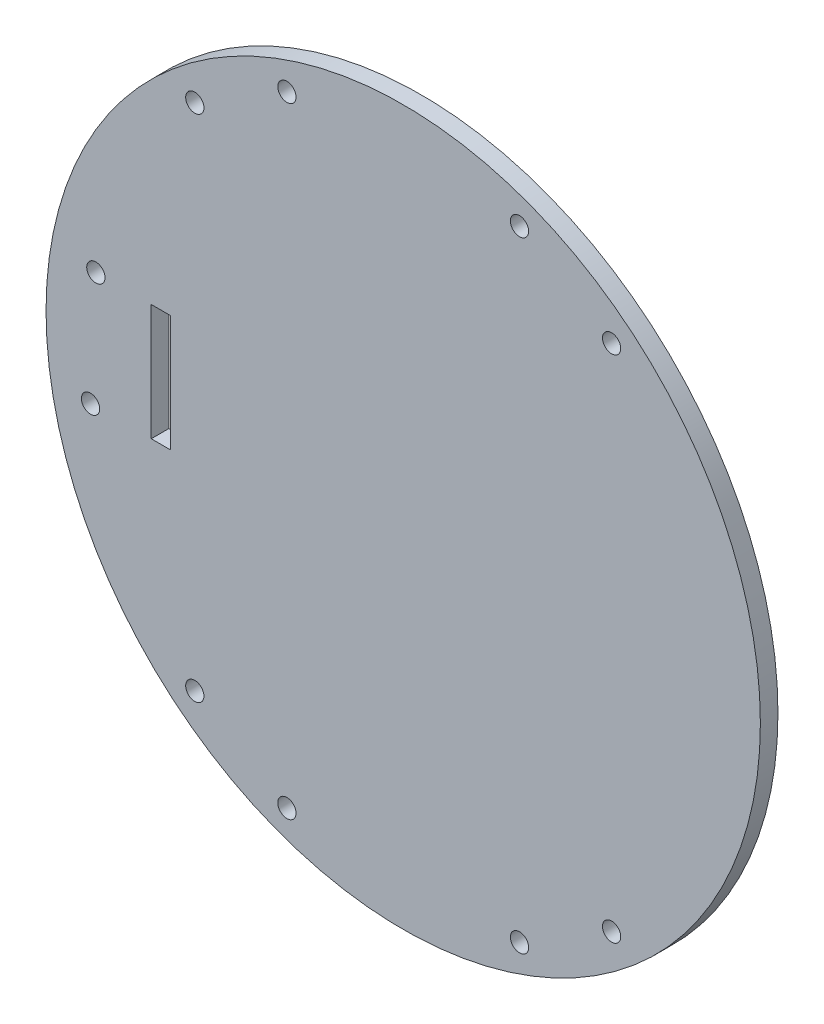
ISO-10303-21;
HEADER;
FILE_DESCRIPTION(('STEP AP214'),'2;1');
FILE_NAME('part.step','',(''),(''),'','','');
FILE_SCHEMA(('AUTOMOTIVE_DESIGN { 1 0 10303 214 1 1 1 1 }'));
ENDSEC;
DATA;
#1=APPLICATION_CONTEXT('core data for automotive mechanical design processes');
#2=APPLICATION_PROTOCOL_DEFINITION('international standard','automotive_design',2000,#1);
#3=PRODUCT_CONTEXT('',#1,'mechanical');
#4=PRODUCT('Part','Part','',(#3));
#5=PRODUCT_RELATED_PRODUCT_CATEGORY('part','',(#4));
#6=PRODUCT_DEFINITION_FORMATION('','',#4);
#7=PRODUCT_DEFINITION_CONTEXT('part definition',#1,'design');
#8=PRODUCT_DEFINITION('design','',#6,#7);
#9=PRODUCT_DEFINITION_SHAPE('','',#8);
#10=(LENGTH_UNIT() NAMED_UNIT(*) SI_UNIT(.MILLI.,.METRE.));
#11=(NAMED_UNIT(*) PLANE_ANGLE_UNIT() SI_UNIT($,.RADIAN.));
#12=(NAMED_UNIT(*) SI_UNIT($,.STERADIAN.) SOLID_ANGLE_UNIT());
#13=UNCERTAINTY_MEASURE_WITH_UNIT(LENGTH_MEASURE(1.E-05),#10,'distance_accuracy_value','');
#14=(GEOMETRIC_REPRESENTATION_CONTEXT(3) GLOBAL_UNCERTAINTY_ASSIGNED_CONTEXT((#13)) GLOBAL_UNIT_ASSIGNED_CONTEXT((#10,
#11,#12)) REPRESENTATION_CONTEXT('',''));
#15=CARTESIAN_POINT('',(0.,0.,0.));
#16=DIRECTION('',(0.,0.,1.));
#17=DIRECTION('',(1.,0.,0.));
#18=AXIS2_PLACEMENT_3D('',#15,#16,#17);
#19=CARTESIAN_POINT('',(-14.9422678098331,5.63357424231195,3.175));
#20=DIRECTION('',(0.,0.,1.));
#21=DIRECTION('',(1.,0.,0.));
#22=AXIS2_PLACEMENT_3D('',#19,#20,#21);
#23=PLANE('',#22);
#24=CARTESIAN_POINT('',(6.05773219016692,61.633574242312,3.175));
#25=DIRECTION('',(0.,0.,1.));
#26=DIRECTION('',(-1.,0.,0.));
#27=AXIS2_PLACEMENT_3D('',#24,#25,#26);
#28=CIRCLE('',#27,1.65);
#29=CARTESIAN_POINT('',(4.40773219016692,61.633574242312,3.175));
#30=VERTEX_POINT('',#29);
#31=EDGE_CURVE('E266',#30,#30,#28,.T.);
#32=ORIENTED_EDGE('',*,*,#31,.F.);
#33=EDGE_LOOP('',(#32));
#34=FACE_BOUND('',#33,.T.);
#35=CARTESIAN_POINT('',(-52.5764221899031,51.6335742423119,3.175));
#36=DIRECTION('',(0.,0.,1.));
#37=DIRECTION('',(1.,0.,0.));
#38=AXIS2_PLACEMENT_3D('',#35,#36,#37);
#39=CIRCLE('',#38,1.65);
#40=CARTESIAN_POINT('',(-50.9264221899031,51.6335742423119,3.175));
#41=VERTEX_POINT('',#40);
#42=EDGE_CURVE('E278',#41,#41,#39,.T.);
#43=ORIENTED_EDGE('',*,*,#42,.F.);
#44=EDGE_LOOP('',(#43));
#45=FACE_BOUND('',#44,.T.);
#46=CARTESIAN_POINT('',(-52.5764221899031,-40.366425757688,3.175));
#47=DIRECTION('',(0.,0.,1.));
#48=DIRECTION('',(-1.,0.,0.));
#49=AXIS2_PLACEMENT_3D('',#46,#47,#48);
#50=CIRCLE('',#49,1.65);
#51=CARTESIAN_POINT('',(-54.2264221899031,-40.366425757688,3.175));
#52=VERTEX_POINT('',#51);
#53=EDGE_CURVE('E290',#52,#52,#50,.T.);
#54=ORIENTED_EDGE('',*,*,#53,.F.);
#55=EDGE_LOOP('',(#54));
#56=FACE_BOUND('',#55,.T.);
#57=CARTESIAN_POINT('',(22.6918865702369,-40.366425757688,3.175));
#58=DIRECTION('',(0.,0.,1.));
#59=DIRECTION('',(1.,0.,0.));
#60=AXIS2_PLACEMENT_3D('',#57,#58,#59);
#61=CIRCLE('',#60,1.65);
#62=CARTESIAN_POINT('',(24.3418865702369,-40.366425757688,3.175));
#63=VERTEX_POINT('',#62);
#64=EDGE_CURVE('E302',#63,#63,#61,.T.);
#65=ORIENTED_EDGE('',*,*,#64,.F.);
#66=EDGE_LOOP('',(#65));
#67=FACE_BOUND('',#66,.T.);
#68=CARTESIAN_POINT('',(-71.403979126716,-4.86642575768805,3.175));
#69=DIRECTION('',(0.,0.,1.));
#70=DIRECTION('',(-1.,0.,0.));
#71=AXIS2_PLACEMENT_3D('',#68,#69,#70);
#72=CIRCLE('',#71,1.64999999999999);
#73=CARTESIAN_POINT('',(-73.053979126716,-4.86642575768805,3.175));
#74=VERTEX_POINT('',#73);
#75=EDGE_CURVE('E102',#74,#74,#72,.T.);
#76=ORIENTED_EDGE('',*,*,#75,.F.);
#77=EDGE_LOOP('',(#76));
#78=FACE_BOUND('',#77,.T.);
#79=CARTESIAN_POINT('',(-14.9422678098331,5.63357424231195,3.175));
#80=DIRECTION('',(0.,0.,1.));
#81=DIRECTION('',(1.,0.,0.));
#82=AXIS2_PLACEMENT_3D('',#79,#80,#81);
#83=CIRCLE('',#82,64.5000000000001);
#84=CARTESIAN_POINT('',(49.557732190167,5.63357424231195,3.175));
#85=VERTEX_POINT('',#84);
#86=EDGE_CURVE('E11',#85,#85,#83,.T.);
#87=ORIENTED_EDGE('',*,*,#86,.T.);
#88=EDGE_LOOP('',(#87));
#89=FACE_BOUND('',#88,.T.);
#90=DIRECTION('',(1.,0.,0.));
#91=VECTOR('',#90,1.);
#92=CARTESIAN_POINT('',(-56.9422678098331,-4.86642575768805,3.175));
#93=LINE('',#92,#91);
#94=CARTESIAN_POINT('',(-60.4422678098331,-4.86642575768805,3.175));
#95=VERTEX_POINT('',#94);
#96=CARTESIAN_POINT('',(-56.9422678098331,-4.86642575768805,3.175));
#97=VERTEX_POINT('',#96);
#98=EDGE_CURVE('E82',#95,#97,#93,.T.);
#99=ORIENTED_EDGE('',*,*,#98,.F.);
#100=DIRECTION('',(0.,-1.,0.));
#101=VECTOR('',#100,1.);
#102=CARTESIAN_POINT('',(-60.4422678098331,16.133574242312,3.175));
#103=LINE('',#102,#101);
#104=CARTESIAN_POINT('',(-60.4422678098331,16.133574242312,3.175));
#105=VERTEX_POINT('',#104);
#106=EDGE_CURVE('E74',#105,#95,#103,.T.);
#107=ORIENTED_EDGE('',*,*,#106,.F.);
#108=DIRECTION('',(-1.,0.,0.));
#109=VECTOR('',#108,1.);
#110=CARTESIAN_POINT('',(-56.9422678098331,16.133574242312,3.175));
#111=LINE('',#110,#109);
#112=CARTESIAN_POINT('',(-56.9422678098331,16.133574242312,3.175));
#113=VERTEX_POINT('',#112);
#114=EDGE_CURVE('E96',#113,#105,#111,.T.);
#115=ORIENTED_EDGE('',*,*,#114,.F.);
#116=DIRECTION('',(0.,1.,0.));
#117=VECTOR('',#116,1.);
#118=CARTESIAN_POINT('',(-56.9422678098331,16.133574242312,3.175));
#119=LINE('',#118,#117);
#120=EDGE_CURVE('E94',#97,#113,#119,.T.);
#121=ORIENTED_EDGE('',*,*,#120,.F.);
#122=EDGE_LOOP('',(#99,#107,#115,#121));
#123=FACE_BOUND('',#122,.T.);
#124=CARTESIAN_POINT('',(-70.4422678098331,16.133574242312,3.175));
#125=DIRECTION('',(0.,0.,1.));
#126=DIRECTION('',(1.,0.,0.));
#127=AXIS2_PLACEMENT_3D('',#124,#125,#126);
#128=CIRCLE('',#127,1.64999999999999);
#129=CARTESIAN_POINT('',(-68.7922678098331,16.133574242312,3.175));
#130=VERTEX_POINT('',#129);
#131=EDGE_CURVE('E308',#130,#130,#128,.T.);
#132=ORIENTED_EDGE('',*,*,#131,.F.);
#133=EDGE_LOOP('',(#132));
#134=FACE_BOUND('',#133,.T.);
#135=CARTESIAN_POINT('',(-35.9422678098331,-50.366425757688,3.175));
#136=DIRECTION('',(0.,0.,1.));
#137=DIRECTION('',(-1.,0.,0.));
#138=AXIS2_PLACEMENT_3D('',#135,#136,#137);
#139=CIRCLE('',#138,1.65);
#140=CARTESIAN_POINT('',(-37.5922678098331,-50.366425757688,3.175));
#141=VERTEX_POINT('',#140);
#142=EDGE_CURVE('E296',#141,#141,#139,.T.);
#143=ORIENTED_EDGE('',*,*,#142,.F.);
#144=EDGE_LOOP('',(#143));
#145=FACE_BOUND('',#144,.T.);
#146=CARTESIAN_POINT('',(6.05773219016693,-50.366425757688,3.175));
#147=DIRECTION('',(0.,0.,1.));
#148=DIRECTION('',(1.,0.,0.));
#149=AXIS2_PLACEMENT_3D('',#146,#147,#148);
#150=CIRCLE('',#149,1.65);
#151=CARTESIAN_POINT('',(7.70773219016693,-50.366425757688,3.175));
#152=VERTEX_POINT('',#151);
#153=EDGE_CURVE('E284',#152,#152,#150,.T.);
#154=ORIENTED_EDGE('',*,*,#153,.F.);
#155=EDGE_LOOP('',(#154));
#156=FACE_BOUND('',#155,.T.);
#157=CARTESIAN_POINT('',(-35.9422678098331,61.633574242312,3.175));
#158=DIRECTION('',(0.,0.,1.));
#159=DIRECTION('',(1.,0.,0.));
#160=AXIS2_PLACEMENT_3D('',#157,#158,#159);
#161=CIRCLE('',#160,1.65);
#162=CARTESIAN_POINT('',(-34.2922678098331,61.633574242312,3.175));
#163=VERTEX_POINT('',#162);
#164=EDGE_CURVE('E272',#163,#163,#161,.T.);
#165=ORIENTED_EDGE('',*,*,#164,.F.);
#166=EDGE_LOOP('',(#165));
#167=FACE_BOUND('',#166,.T.);
#168=CARTESIAN_POINT('',(22.6918865702369,51.633574242312,3.175));
#169=DIRECTION('',(0.,0.,1.));
#170=DIRECTION('',(-1.,0.,0.));
#171=AXIS2_PLACEMENT_3D('',#168,#169,#170);
#172=CIRCLE('',#171,1.65);
#173=CARTESIAN_POINT('',(21.0418865702369,51.633574242312,3.175));
#174=VERTEX_POINT('',#173);
#175=EDGE_CURVE('E257',#174,#174,#172,.T.);
#176=ORIENTED_EDGE('',*,*,#175,.F.);
#177=EDGE_LOOP('',(#176));
#178=FACE_BOUND('',#177,.T.);
#179=ADVANCED_FACE('F33',(#34,#45,#56,#67,#78,#89,#123,#134,#145,#156,#167,#178),#23,.T.);
#180=CARTESIAN_POINT('',(-14.9422678098331,5.63357424231195,0.));
#181=DIRECTION('',(0.,0.,1.));
#182=DIRECTION('',(1.,0.,0.));
#183=AXIS2_PLACEMENT_3D('',#180,#181,#182);
#184=PLANE('',#183);
#185=CARTESIAN_POINT('',(-14.9422678098331,5.63357424231195,0.));
#186=DIRECTION('',(0.,0.,1.));
#187=DIRECTION('',(1.,0.,0.));
#188=AXIS2_PLACEMENT_3D('',#185,#186,#187);
#189=CIRCLE('',#188,64.5000000000001);
#190=CARTESIAN_POINT('',(49.557732190167,5.63357424231195,0.));
#191=VERTEX_POINT('',#190);
#192=EDGE_CURVE('E37',#191,#191,#189,.T.);
#193=ORIENTED_EDGE('',*,*,#192,.F.);
#194=EDGE_LOOP('',(#193));
#195=FACE_BOUND('',#194,.T.);
#196=DIRECTION('',(0.,-1.,0.));
#197=VECTOR('',#196,1.);
#198=CARTESIAN_POINT('',(-60.4422678098331,16.133574242312,0.));
#199=LINE('',#198,#197);
#200=CARTESIAN_POINT('',(-60.4422678098331,16.133574242312,0.));
#201=VERTEX_POINT('',#200);
#202=CARTESIAN_POINT('',(-60.4422678098331,-4.86642575768805,0.));
#203=VERTEX_POINT('',#202);
#204=EDGE_CURVE('E56',#201,#203,#199,.T.);
#205=ORIENTED_EDGE('',*,*,#204,.T.);
#206=DIRECTION('',(1.,0.,0.));
#207=VECTOR('',#206,1.);
#208=CARTESIAN_POINT('',(-56.9422678098331,-4.86642575768805,0.));
#209=LINE('',#208,#207);
#210=CARTESIAN_POINT('',(-56.9422678098331,-4.86642575768805,0.));
#211=VERTEX_POINT('',#210);
#212=EDGE_CURVE('E89',#203,#211,#209,.T.);
#213=ORIENTED_EDGE('',*,*,#212,.T.);
#214=DIRECTION('',(0.,1.,0.));
#215=VECTOR('',#214,1.);
#216=CARTESIAN_POINT('',(-56.9422678098331,16.133574242312,0.));
#217=LINE('',#216,#215);
#218=CARTESIAN_POINT('',(-56.9422678098331,16.133574242312,0.));
#219=VERTEX_POINT('',#218);
#220=EDGE_CURVE('E104',#211,#219,#217,.T.);
#221=ORIENTED_EDGE('',*,*,#220,.T.);
#222=DIRECTION('',(-1.,0.,0.));
#223=VECTOR('',#222,1.);
#224=CARTESIAN_POINT('',(-56.9422678098331,16.133574242312,0.));
#225=LINE('',#224,#223);
#226=EDGE_CURVE('E83',#219,#201,#225,.T.);
#227=ORIENTED_EDGE('',*,*,#226,.T.);
#228=EDGE_LOOP('',(#205,#213,#221,#227));
#229=FACE_BOUND('',#228,.T.);
#230=CARTESIAN_POINT('',(-71.403979126716,-4.86642575768805,0.));
#231=DIRECTION('',(0.,0.,1.));
#232=DIRECTION('',(-1.,0.,0.));
#233=AXIS2_PLACEMENT_3D('',#230,#231,#232);
#234=CIRCLE('',#233,1.64999999999999);
#235=CARTESIAN_POINT('',(-73.053979126716,-4.86642575768805,0.));
#236=VERTEX_POINT('',#235);
#237=EDGE_CURVE('E311',#236,#236,#234,.T.);
#238=ORIENTED_EDGE('',*,*,#237,.T.);
#239=EDGE_LOOP('',(#238));
#240=FACE_BOUND('',#239,.T.);
#241=CARTESIAN_POINT('',(-70.4422678098331,16.133574242312,0.));
#242=DIRECTION('',(0.,0.,1.));
#243=DIRECTION('',(1.,0.,0.));
#244=AXIS2_PLACEMENT_3D('',#241,#242,#243);
#245=CIRCLE('',#244,1.64999999999999);
#246=CARTESIAN_POINT('',(-68.7922678098331,16.133574242312,0.));
#247=VERTEX_POINT('',#246);
#248=EDGE_CURVE('E305',#247,#247,#245,.T.);
#249=ORIENTED_EDGE('',*,*,#248,.T.);
#250=EDGE_LOOP('',(#249));
#251=FACE_BOUND('',#250,.T.);
#252=CARTESIAN_POINT('',(22.6918865702369,-40.366425757688,0.));
#253=DIRECTION('',(0.,0.,1.));
#254=DIRECTION('',(1.,0.,0.));
#255=AXIS2_PLACEMENT_3D('',#252,#253,#254);
#256=CIRCLE('',#255,1.65);
#257=CARTESIAN_POINT('',(24.3418865702369,-40.366425757688,0.));
#258=VERTEX_POINT('',#257);
#259=EDGE_CURVE('E299',#258,#258,#256,.T.);
#260=ORIENTED_EDGE('',*,*,#259,.T.);
#261=EDGE_LOOP('',(#260));
#262=FACE_BOUND('',#261,.T.);
#263=CARTESIAN_POINT('',(-35.9422678098331,-50.366425757688,0.));
#264=DIRECTION('',(0.,0.,1.));
#265=DIRECTION('',(-1.,0.,0.));
#266=AXIS2_PLACEMENT_3D('',#263,#264,#265);
#267=CIRCLE('',#266,1.65);
#268=CARTESIAN_POINT('',(-37.5922678098331,-50.366425757688,0.));
#269=VERTEX_POINT('',#268);
#270=EDGE_CURVE('E293',#269,#269,#267,.T.);
#271=ORIENTED_EDGE('',*,*,#270,.T.);
#272=EDGE_LOOP('',(#271));
#273=FACE_BOUND('',#272,.T.);
#274=CARTESIAN_POINT('',(-52.5764221899031,-40.366425757688,0.));
#275=DIRECTION('',(0.,0.,1.));
#276=DIRECTION('',(-1.,0.,0.));
#277=AXIS2_PLACEMENT_3D('',#274,#275,#276);
#278=CIRCLE('',#277,1.65);
#279=CARTESIAN_POINT('',(-54.2264221899031,-40.366425757688,0.));
#280=VERTEX_POINT('',#279);
#281=EDGE_CURVE('E287',#280,#280,#278,.T.);
#282=ORIENTED_EDGE('',*,*,#281,.T.);
#283=EDGE_LOOP('',(#282));
#284=FACE_BOUND('',#283,.T.);
#285=CARTESIAN_POINT('',(6.05773219016693,-50.366425757688,0.));
#286=DIRECTION('',(0.,0.,1.));
#287=DIRECTION('',(1.,0.,0.));
#288=AXIS2_PLACEMENT_3D('',#285,#286,#287);
#289=CIRCLE('',#288,1.65);
#290=CARTESIAN_POINT('',(7.70773219016693,-50.366425757688,0.));
#291=VERTEX_POINT('',#290);
#292=EDGE_CURVE('E281',#291,#291,#289,.T.);
#293=ORIENTED_EDGE('',*,*,#292,.T.);
#294=EDGE_LOOP('',(#293));
#295=FACE_BOUND('',#294,.T.);
#296=CARTESIAN_POINT('',(-52.5764221899031,51.6335742423119,0.));
#297=DIRECTION('',(0.,0.,1.));
#298=DIRECTION('',(1.,0.,0.));
#299=AXIS2_PLACEMENT_3D('',#296,#297,#298);
#300=CIRCLE('',#299,1.65);
#301=CARTESIAN_POINT('',(-50.9264221899031,51.6335742423119,0.));
#302=VERTEX_POINT('',#301);
#303=EDGE_CURVE('E275',#302,#302,#300,.T.);
#304=ORIENTED_EDGE('',*,*,#303,.T.);
#305=EDGE_LOOP('',(#304));
#306=FACE_BOUND('',#305,.T.);
#307=CARTESIAN_POINT('',(-35.9422678098331,61.633574242312,0.));
#308=DIRECTION('',(0.,0.,1.));
#309=DIRECTION('',(1.,0.,0.));
#310=AXIS2_PLACEMENT_3D('',#307,#308,#309);
#311=CIRCLE('',#310,1.65);
#312=CARTESIAN_POINT('',(-34.2922678098331,61.633574242312,0.));
#313=VERTEX_POINT('',#312);
#314=EDGE_CURVE('E269',#313,#313,#311,.T.);
#315=ORIENTED_EDGE('',*,*,#314,.T.);
#316=EDGE_LOOP('',(#315));
#317=FACE_BOUND('',#316,.T.);
#318=CARTESIAN_POINT('',(6.05773219016692,61.633574242312,0.));
#319=DIRECTION('',(0.,0.,1.));
#320=DIRECTION('',(-1.,0.,0.));
#321=AXIS2_PLACEMENT_3D('',#318,#319,#320);
#322=CIRCLE('',#321,1.65);
#323=CARTESIAN_POINT('',(4.40773219016692,61.633574242312,0.));
#324=VERTEX_POINT('',#323);
#325=EDGE_CURVE('E263',#324,#324,#322,.T.);
#326=ORIENTED_EDGE('',*,*,#325,.T.);
#327=EDGE_LOOP('',(#326));
#328=FACE_BOUND('',#327,.T.);
#329=CARTESIAN_POINT('',(22.6918865702369,51.633574242312,0.));
#330=DIRECTION('',(0.,0.,1.));
#331=DIRECTION('',(-1.,0.,0.));
#332=AXIS2_PLACEMENT_3D('',#329,#330,#331);
#333=CIRCLE('',#332,1.65);
#334=CARTESIAN_POINT('',(21.0418865702369,51.633574242312,0.));
#335=VERTEX_POINT('',#334);
#336=EDGE_CURVE('E260',#335,#335,#333,.T.);
#337=ORIENTED_EDGE('',*,*,#336,.T.);
#338=EDGE_LOOP('',(#337));
#339=FACE_BOUND('',#338,.T.);
#340=ADVANCED_FACE('F115',(#195,#229,#240,#251,#262,#273,#284,#295,#306,#317,#328,#339),#184,.F.);
#341=CARTESIAN_POINT('',(-14.9422678098331,5.63357424231195,3.175));
#342=DIRECTION('',(0.,0.,-1.));
#343=DIRECTION('',(-1.,0.,0.));
#344=AXIS2_PLACEMENT_3D('',#341,#342,#343);
#345=CYLINDRICAL_SURFACE('',#344,64.5000000000001);
#346=ORIENTED_EDGE('',*,*,#86,.F.);
#347=EDGE_LOOP('',(#346));
#348=FACE_BOUND('',#347,.T.);
#349=ORIENTED_EDGE('',*,*,#192,.T.);
#350=EDGE_LOOP('',(#349));
#351=FACE_BOUND('',#350,.T.);
#352=ADVANCED_FACE('F35',(#348,#351),#345,.T.);
#353=CARTESIAN_POINT('',(-60.4422678098331,16.133574242312,3.175));
#354=DIRECTION('',(1.,0.,0.));
#355=DIRECTION('',(0.,0.,-1.));
#356=AXIS2_PLACEMENT_3D('',#353,#354,#355);
#357=PLANE('',#356);
#358=ORIENTED_EDGE('',*,*,#204,.F.);
#359=DIRECTION('',(0.,0.,-1.));
#360=VECTOR('',#359,1.);
#361=CARTESIAN_POINT('',(-60.4422678098331,16.133574242312,3.175));
#362=LINE('',#361,#360);
#363=EDGE_CURVE('E78',#105,#201,#362,.T.);
#364=ORIENTED_EDGE('',*,*,#363,.F.);
#365=ORIENTED_EDGE('',*,*,#106,.T.);
#366=DIRECTION('',(0.,0.,-1.));
#367=VECTOR('',#366,1.);
#368=CARTESIAN_POINT('',(-60.4422678098331,-4.86642575768805,3.175));
#369=LINE('',#368,#367);
#370=EDGE_CURVE('E77',#95,#203,#369,.T.);
#371=ORIENTED_EDGE('',*,*,#370,.T.);
#372=EDGE_LOOP('',(#358,#364,#365,#371));
#373=FACE_BOUND('',#372,.T.);
#374=ADVANCED_FACE('F76',(#373),#357,.T.);
#375=CARTESIAN_POINT('',(-56.9422678098331,-4.86642575768805,3.175));
#376=DIRECTION('',(0.,1.,0.));
#377=DIRECTION('',(0.,0.,1.));
#378=AXIS2_PLACEMENT_3D('',#375,#376,#377);
#379=PLANE('',#378);
#380=ORIENTED_EDGE('',*,*,#212,.F.);
#381=ORIENTED_EDGE('',*,*,#370,.F.);
#382=ORIENTED_EDGE('',*,*,#98,.T.);
#383=DIRECTION('',(0.,0.,-1.));
#384=VECTOR('',#383,1.);
#385=CARTESIAN_POINT('',(-56.9422678098331,-4.86642575768805,3.175));
#386=LINE('',#385,#384);
#387=EDGE_CURVE('E90',#97,#211,#386,.T.);
#388=ORIENTED_EDGE('',*,*,#387,.T.);
#389=EDGE_LOOP('',(#380,#381,#382,#388));
#390=FACE_BOUND('',#389,.T.);
#391=ADVANCED_FACE('F86',(#390),#379,.T.);
#392=CARTESIAN_POINT('',(-56.9422678098331,16.133574242312,3.175));
#393=DIRECTION('',(-1.,0.,0.));
#394=DIRECTION('',(0.,0.,1.));
#395=AXIS2_PLACEMENT_3D('',#392,#393,#394);
#396=PLANE('',#395);
#397=ORIENTED_EDGE('',*,*,#220,.F.);
#398=ORIENTED_EDGE('',*,*,#387,.F.);
#399=ORIENTED_EDGE('',*,*,#120,.T.);
#400=DIRECTION('',(0.,0.,-1.));
#401=VECTOR('',#400,1.);
#402=CARTESIAN_POINT('',(-56.9422678098331,16.133574242312,3.175));
#403=LINE('',#402,#401);
#404=EDGE_CURVE('E48',#113,#219,#403,.T.);
#405=ORIENTED_EDGE('',*,*,#404,.T.);
#406=EDGE_LOOP('',(#397,#398,#399,#405));
#407=FACE_BOUND('',#406,.T.);
#408=ADVANCED_FACE('F113',(#407),#396,.T.);
#409=CARTESIAN_POINT('',(-56.9422678098331,16.133574242312,3.175));
#410=DIRECTION('',(0.,-1.,0.));
#411=DIRECTION('',(0.,0.,-1.));
#412=AXIS2_PLACEMENT_3D('',#409,#410,#411);
#413=PLANE('',#412);
#414=ORIENTED_EDGE('',*,*,#226,.F.);
#415=ORIENTED_EDGE('',*,*,#404,.F.);
#416=ORIENTED_EDGE('',*,*,#114,.T.);
#417=ORIENTED_EDGE('',*,*,#363,.T.);
#418=EDGE_LOOP('',(#414,#415,#416,#417));
#419=FACE_BOUND('',#418,.T.);
#420=ADVANCED_FACE('F117',(#419),#413,.T.);
#421=CARTESIAN_POINT('',(-71.403979126716,-4.86642575768805,3.175));
#422=DIRECTION('',(0.,0.,-1.));
#423=DIRECTION('',(-1.,0.,0.));
#424=AXIS2_PLACEMENT_3D('',#421,#422,#423);
#425=CYLINDRICAL_SURFACE('',#424,1.64999999999999);
#426=ORIENTED_EDGE('',*,*,#75,.T.);
#427=EDGE_LOOP('',(#426));
#428=FACE_BOUND('',#427,.T.);
#429=ORIENTED_EDGE('',*,*,#237,.F.);
#430=EDGE_LOOP('',(#429));
#431=FACE_BOUND('',#430,.T.);
#432=ADVANCED_FACE('F119',(#428,#431),#425,.F.);
#433=CARTESIAN_POINT('',(-70.4422678098331,16.133574242312,3.175));
#434=DIRECTION('',(0.,0.,-1.));
#435=DIRECTION('',(-1.,0.,0.));
#436=AXIS2_PLACEMENT_3D('',#433,#434,#435);
#437=CYLINDRICAL_SURFACE('',#436,1.64999999999999);
#438=ORIENTED_EDGE('',*,*,#131,.T.);
#439=EDGE_LOOP('',(#438));
#440=FACE_BOUND('',#439,.T.);
#441=ORIENTED_EDGE('',*,*,#248,.F.);
#442=EDGE_LOOP('',(#441));
#443=FACE_BOUND('',#442,.T.);
#444=ADVANCED_FACE('F125',(#440,#443),#437,.F.);
#445=CARTESIAN_POINT('',(22.6918865702369,-40.366425757688,3.175));
#446=DIRECTION('',(0.,0.,-1.));
#447=DIRECTION('',(-1.,0.,0.));
#448=AXIS2_PLACEMENT_3D('',#445,#446,#447);
#449=CYLINDRICAL_SURFACE('',#448,1.65);
#450=ORIENTED_EDGE('',*,*,#64,.T.);
#451=EDGE_LOOP('',(#450));
#452=FACE_BOUND('',#451,.T.);
#453=ORIENTED_EDGE('',*,*,#259,.F.);
#454=EDGE_LOOP('',(#453));
#455=FACE_BOUND('',#454,.T.);
#456=ADVANCED_FACE('F170',(#452,#455),#449,.F.);
#457=CARTESIAN_POINT('',(-35.9422678098331,-50.366425757688,3.175));
#458=DIRECTION('',(0.,0.,-1.));
#459=DIRECTION('',(-1.,0.,0.));
#460=AXIS2_PLACEMENT_3D('',#457,#458,#459);
#461=CYLINDRICAL_SURFACE('',#460,1.65);
#462=ORIENTED_EDGE('',*,*,#142,.T.);
#463=EDGE_LOOP('',(#462));
#464=FACE_BOUND('',#463,.T.);
#465=ORIENTED_EDGE('',*,*,#270,.F.);
#466=EDGE_LOOP('',(#465));
#467=FACE_BOUND('',#466,.T.);
#468=ADVANCED_FACE('F180',(#464,#467),#461,.F.);
#469=CARTESIAN_POINT('',(-52.5764221899031,-40.366425757688,3.175));
#470=DIRECTION('',(0.,0.,-1.));
#471=DIRECTION('',(-1.,0.,0.));
#472=AXIS2_PLACEMENT_3D('',#469,#470,#471);
#473=CYLINDRICAL_SURFACE('',#472,1.65);
#474=ORIENTED_EDGE('',*,*,#53,.T.);
#475=EDGE_LOOP('',(#474));
#476=FACE_BOUND('',#475,.T.);
#477=ORIENTED_EDGE('',*,*,#281,.F.);
#478=EDGE_LOOP('',(#477));
#479=FACE_BOUND('',#478,.T.);
#480=ADVANCED_FACE('F190',(#476,#479),#473,.F.);
#481=CARTESIAN_POINT('',(6.05773219016693,-50.366425757688,3.175));
#482=DIRECTION('',(0.,0.,-1.));
#483=DIRECTION('',(-1.,0.,0.));
#484=AXIS2_PLACEMENT_3D('',#481,#482,#483);
#485=CYLINDRICAL_SURFACE('',#484,1.65);
#486=ORIENTED_EDGE('',*,*,#153,.T.);
#487=EDGE_LOOP('',(#486));
#488=FACE_BOUND('',#487,.T.);
#489=ORIENTED_EDGE('',*,*,#292,.F.);
#490=EDGE_LOOP('',(#489));
#491=FACE_BOUND('',#490,.T.);
#492=ADVANCED_FACE('F200',(#488,#491),#485,.F.);
#493=CARTESIAN_POINT('',(-52.5764221899031,51.6335742423119,3.175));
#494=DIRECTION('',(0.,0.,-1.));
#495=DIRECTION('',(-1.,0.,0.));
#496=AXIS2_PLACEMENT_3D('',#493,#494,#495);
#497=CYLINDRICAL_SURFACE('',#496,1.65);
#498=ORIENTED_EDGE('',*,*,#42,.T.);
#499=EDGE_LOOP('',(#498));
#500=FACE_BOUND('',#499,.T.);
#501=ORIENTED_EDGE('',*,*,#303,.F.);
#502=EDGE_LOOP('',(#501));
#503=FACE_BOUND('',#502,.T.);
#504=ADVANCED_FACE('F210',(#500,#503),#497,.F.);
#505=CARTESIAN_POINT('',(-35.9422678098331,61.633574242312,3.175));
#506=DIRECTION('',(0.,0.,-1.));
#507=DIRECTION('',(-1.,0.,0.));
#508=AXIS2_PLACEMENT_3D('',#505,#506,#507);
#509=CYLINDRICAL_SURFACE('',#508,1.65);
#510=ORIENTED_EDGE('',*,*,#164,.T.);
#511=EDGE_LOOP('',(#510));
#512=FACE_BOUND('',#511,.T.);
#513=ORIENTED_EDGE('',*,*,#314,.F.);
#514=EDGE_LOOP('',(#513));
#515=FACE_BOUND('',#514,.T.);
#516=ADVANCED_FACE('F220',(#512,#515),#509,.F.);
#517=CARTESIAN_POINT('',(6.05773219016692,61.633574242312,3.175));
#518=DIRECTION('',(0.,0.,-1.));
#519=DIRECTION('',(-1.,0.,0.));
#520=AXIS2_PLACEMENT_3D('',#517,#518,#519);
#521=CYLINDRICAL_SURFACE('',#520,1.65);
#522=ORIENTED_EDGE('',*,*,#31,.T.);
#523=EDGE_LOOP('',(#522));
#524=FACE_BOUND('',#523,.T.);
#525=ORIENTED_EDGE('',*,*,#325,.F.);
#526=EDGE_LOOP('',(#525));
#527=FACE_BOUND('',#526,.T.);
#528=ADVANCED_FACE('F230',(#524,#527),#521,.F.);
#529=CARTESIAN_POINT('',(22.6918865702369,51.633574242312,3.175));
#530=DIRECTION('',(0.,0.,-1.));
#531=DIRECTION('',(-1.,0.,0.));
#532=AXIS2_PLACEMENT_3D('',#529,#530,#531);
#533=CYLINDRICAL_SURFACE('',#532,1.65);
#534=ORIENTED_EDGE('',*,*,#175,.T.);
#535=EDGE_LOOP('',(#534));
#536=FACE_BOUND('',#535,.T.);
#537=ORIENTED_EDGE('',*,*,#336,.F.);
#538=EDGE_LOOP('',(#537));
#539=FACE_BOUND('',#538,.T.);
#540=ADVANCED_FACE('F240',(#536,#539),#533,.F.);
#541=CLOSED_SHELL('',(#179,#340,#352,#374,#391,#408,#420,#432,#444,#456,#468,#480,#492,#504,
#516,#528,#540));
#542=MANIFOLD_SOLID_BREP('B2',#541);
#543=ADVANCED_BREP_SHAPE_REPRESENTATION('',(#18,#542),#14);
#544=SHAPE_DEFINITION_REPRESENTATION(#9,#543);
ENDSEC;
END-ISO-10303-21;
